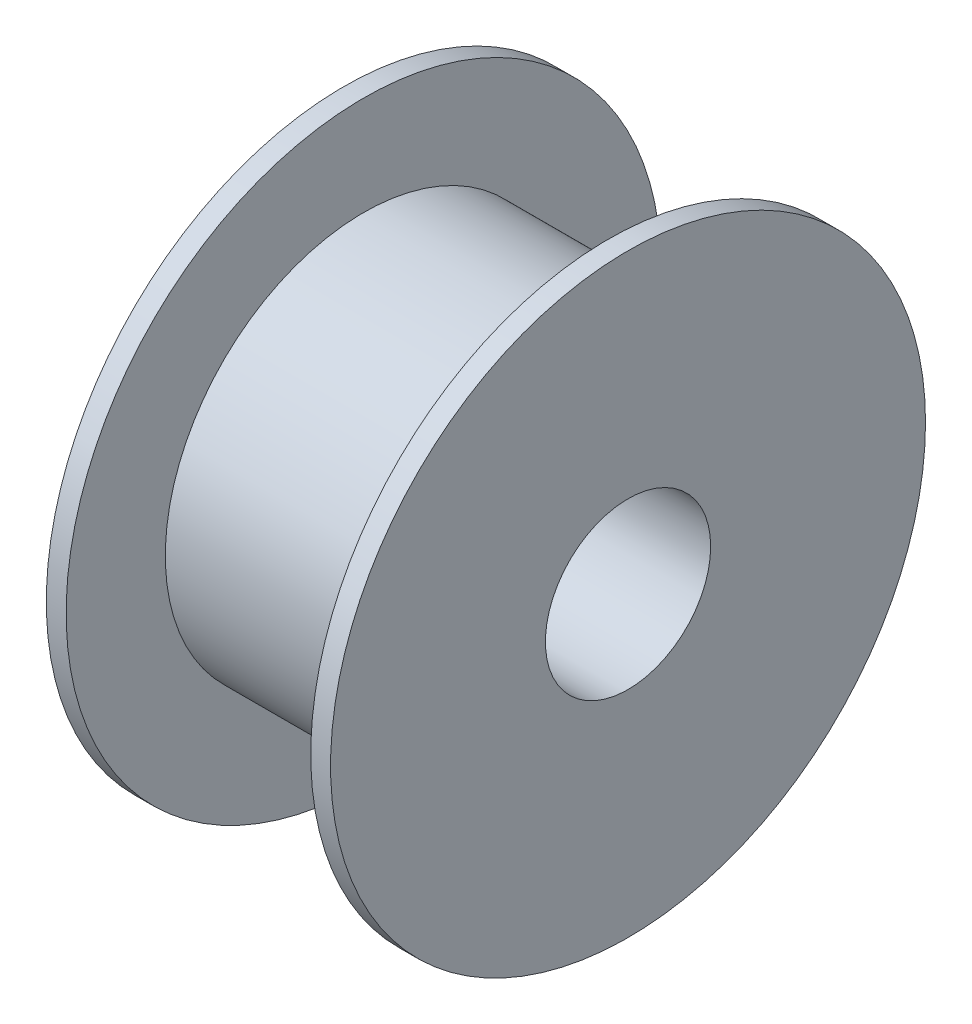
ISO-10303-21;
HEADER;
FILE_DESCRIPTION(('STEP AP214'),'2;1');
FILE_NAME('part.step','',(''),(''),'','','');
FILE_SCHEMA(('AUTOMOTIVE_DESIGN { 1 0 10303 214 1 1 1 1 }'));
ENDSEC;
DATA;
#1=APPLICATION_CONTEXT('core data for automotive mechanical design processes');
#2=APPLICATION_PROTOCOL_DEFINITION('international standard','automotive_design',2000,#1);
#3=PRODUCT_CONTEXT('',#1,'mechanical');
#4=PRODUCT('Part','Part','',(#3));
#5=PRODUCT_RELATED_PRODUCT_CATEGORY('part','',(#4));
#6=PRODUCT_DEFINITION_FORMATION('','',#4);
#7=PRODUCT_DEFINITION_CONTEXT('part definition',#1,'design');
#8=PRODUCT_DEFINITION('design','',#6,#7);
#9=PRODUCT_DEFINITION_SHAPE('','',#8);
#10=(LENGTH_UNIT() NAMED_UNIT(*) SI_UNIT(.MILLI.,.METRE.));
#11=(NAMED_UNIT(*) PLANE_ANGLE_UNIT() SI_UNIT($,.RADIAN.));
#12=(NAMED_UNIT(*) SI_UNIT($,.STERADIAN.) SOLID_ANGLE_UNIT());
#13=UNCERTAINTY_MEASURE_WITH_UNIT(LENGTH_MEASURE(1.E-05),#10,'distance_accuracy_value','');
#14=(GEOMETRIC_REPRESENTATION_CONTEXT(3) GLOBAL_UNCERTAINTY_ASSIGNED_CONTEXT((#13)) GLOBAL_UNIT_ASSIGNED_CONTEXT((#10,
#11,#12)) REPRESENTATION_CONTEXT('',''));
#15=CARTESIAN_POINT('',(0.,0.,0.));
#16=DIRECTION('',(0.,0.,1.));
#17=DIRECTION('',(1.,0.,0.));
#18=AXIS2_PLACEMENT_3D('',#15,#16,#17);
#19=CARTESIAN_POINT('',(-0.600000000000001,9.,0.));
#20=DIRECTION('',(-1.,0.,0.));
#21=DIRECTION('',(0.,0.,1.));
#22=AXIS2_PLACEMENT_3D('',#19,#20,#21);
#23=PLANE('',#22);
#24=CARTESIAN_POINT('',(-0.6,0.,0.));
#25=DIRECTION('',(1.,0.,0.));
#26=DIRECTION('',(0.,0.,-1.));
#27=AXIS2_PLACEMENT_3D('',#24,#25,#26);
#28=CIRCLE('',#27,2.5);
#29=CARTESIAN_POINT('',(-0.6,0.,-2.5));
#30=VERTEX_POINT('',#29);
#31=EDGE_CURVE('E10',#30,#30,#28,.T.);
#32=ORIENTED_EDGE('',*,*,#31,.T.);
#33=EDGE_LOOP('',(#32));
#34=FACE_BOUND('',#33,.T.);
#35=CARTESIAN_POINT('',(-0.600000000000001,0.,0.));
#36=DIRECTION('',(1.,0.,0.));
#37=DIRECTION('',(0.,0.,-1.));
#38=AXIS2_PLACEMENT_3D('',#35,#36,#37);
#39=CIRCLE('',#38,9.);
#40=CARTESIAN_POINT('',(-0.600000000000001,0.,-9.));
#41=VERTEX_POINT('',#40);
#42=EDGE_CURVE('E63',#41,#41,#39,.T.);
#43=ORIENTED_EDGE('',*,*,#42,.F.);
#44=EDGE_LOOP('',(#43));
#45=FACE_BOUND('',#44,.T.);
#46=ADVANCED_FACE('F35',(#34,#45),#23,.T.);
#47=CARTESIAN_POINT('',(-0.600000000000001,0.,0.));
#48=DIRECTION('',(1.,0.,0.));
#49=DIRECTION('',(0.,0.,-1.));
#50=AXIS2_PLACEMENT_3D('',#47,#48,#49);
#51=CYLINDRICAL_SURFACE('',#50,2.5);
#52=CARTESIAN_POINT('',(8.,0.,0.));
#53=DIRECTION('',(1.,0.,0.));
#54=DIRECTION('',(0.,0.,-1.));
#55=AXIS2_PLACEMENT_3D('',#52,#53,#54);
#56=CIRCLE('',#55,2.5);
#57=CARTESIAN_POINT('',(8.,0.,-2.5));
#58=VERTEX_POINT('',#57);
#59=EDGE_CURVE('E41',#58,#58,#56,.T.);
#60=ORIENTED_EDGE('',*,*,#59,.T.);
#61=EDGE_LOOP('',(#60));
#62=FACE_BOUND('',#61,.T.);
#63=ORIENTED_EDGE('',*,*,#31,.F.);
#64=EDGE_LOOP('',(#63));
#65=FACE_BOUND('',#64,.T.);
#66=ADVANCED_FACE('F71',(#62,#65),#51,.F.);
#67=CARTESIAN_POINT('',(8.,2.5,0.));
#68=DIRECTION('',(1.,0.,0.));
#69=DIRECTION('',(0.,0.,-1.));
#70=AXIS2_PLACEMENT_3D('',#67,#68,#69);
#71=PLANE('',#70);
#72=CARTESIAN_POINT('',(8.,0.,0.));
#73=DIRECTION('',(1.,0.,0.));
#74=DIRECTION('',(0.,0.,-1.));
#75=AXIS2_PLACEMENT_3D('',#72,#73,#74);
#76=CIRCLE('',#75,9.);
#77=CARTESIAN_POINT('',(8.,0.,-9.));
#78=VERTEX_POINT('',#77);
#79=EDGE_CURVE('E45',#78,#78,#76,.T.);
#80=ORIENTED_EDGE('',*,*,#79,.T.);
#81=EDGE_LOOP('',(#80));
#82=FACE_BOUND('',#81,.T.);
#83=ORIENTED_EDGE('',*,*,#59,.F.);
#84=EDGE_LOOP('',(#83));
#85=FACE_BOUND('',#84,.T.);
#86=ADVANCED_FACE('F75',(#82,#85),#71,.T.);
#87=CARTESIAN_POINT('',(-0.600000000000001,0.,0.));
#88=DIRECTION('',(1.,0.,0.));
#89=DIRECTION('',(0.,0.,-1.));
#90=AXIS2_PLACEMENT_3D('',#87,#88,#89);
#91=CYLINDRICAL_SURFACE('',#90,9.);
#92=CARTESIAN_POINT('',(7.4,0.,0.));
#93=DIRECTION('',(1.,0.,0.));
#94=DIRECTION('',(0.,0.,-1.));
#95=AXIS2_PLACEMENT_3D('',#92,#93,#94);
#96=CIRCLE('',#95,9.);
#97=CARTESIAN_POINT('',(7.4,0.,-9.));
#98=VERTEX_POINT('',#97);
#99=EDGE_CURVE('E49',#98,#98,#96,.T.);
#100=ORIENTED_EDGE('',*,*,#99,.T.);
#101=EDGE_LOOP('',(#100));
#102=FACE_BOUND('',#101,.T.);
#103=ORIENTED_EDGE('',*,*,#79,.F.);
#104=EDGE_LOOP('',(#103));
#105=FACE_BOUND('',#104,.T.);
#106=ADVANCED_FACE('F79',(#102,#105),#91,.T.);
#107=CARTESIAN_POINT('',(7.4,9.,0.));
#108=DIRECTION('',(-1.,0.,0.));
#109=DIRECTION('',(0.,0.,1.));
#110=AXIS2_PLACEMENT_3D('',#107,#108,#109);
#111=PLANE('',#110);
#112=CARTESIAN_POINT('',(7.4,0.,0.));
#113=DIRECTION('',(1.,0.,0.));
#114=DIRECTION('',(0.,0.,-1.));
#115=AXIS2_PLACEMENT_3D('',#112,#113,#114);
#116=CIRCLE('',#115,6.);
#117=CARTESIAN_POINT('',(7.4,0.,-6.));
#118=VERTEX_POINT('',#117);
#119=EDGE_CURVE('E54',#118,#118,#116,.T.);
#120=ORIENTED_EDGE('',*,*,#119,.T.);
#121=EDGE_LOOP('',(#120));
#122=FACE_BOUND('',#121,.T.);
#123=ORIENTED_EDGE('',*,*,#99,.F.);
#124=EDGE_LOOP('',(#123));
#125=FACE_BOUND('',#124,.T.);
#126=ADVANCED_FACE('F86',(#122,#125),#111,.T.);
#127=CARTESIAN_POINT('',(-0.600000000000001,0.,0.));
#128=DIRECTION('',(1.,0.,0.));
#129=DIRECTION('',(0.,0.,-1.));
#130=AXIS2_PLACEMENT_3D('',#127,#128,#129);
#131=CYLINDRICAL_SURFACE('',#130,6.);
#132=CARTESIAN_POINT('',(0.,0.,0.));
#133=DIRECTION('',(1.,0.,0.));
#134=DIRECTION('',(0.,0.,-1.));
#135=AXIS2_PLACEMENT_3D('',#132,#133,#134);
#136=CIRCLE('',#135,6.);
#137=CARTESIAN_POINT('',(0.,0.,-6.));
#138=VERTEX_POINT('',#137);
#139=EDGE_CURVE('E57',#138,#138,#136,.T.);
#140=ORIENTED_EDGE('',*,*,#139,.T.);
#141=EDGE_LOOP('',(#140));
#142=FACE_BOUND('',#141,.T.);
#143=ORIENTED_EDGE('',*,*,#119,.F.);
#144=EDGE_LOOP('',(#143));
#145=FACE_BOUND('',#144,.T.);
#146=ADVANCED_FACE('F90',(#142,#145),#131,.T.);
#147=CARTESIAN_POINT('',(0.,6.,0.));
#148=DIRECTION('',(1.,0.,0.));
#149=DIRECTION('',(0.,0.,-1.));
#150=AXIS2_PLACEMENT_3D('',#147,#148,#149);
#151=PLANE('',#150);
#152=CARTESIAN_POINT('',(0.,0.,0.));
#153=DIRECTION('',(1.,0.,0.));
#154=DIRECTION('',(0.,0.,-1.));
#155=AXIS2_PLACEMENT_3D('',#152,#153,#154);
#156=CIRCLE('',#155,9.);
#157=CARTESIAN_POINT('',(0.,0.,-9.));
#158=VERTEX_POINT('',#157);
#159=EDGE_CURVE('E60',#158,#158,#156,.T.);
#160=ORIENTED_EDGE('',*,*,#159,.T.);
#161=EDGE_LOOP('',(#160));
#162=FACE_BOUND('',#161,.T.);
#163=ORIENTED_EDGE('',*,*,#139,.F.);
#164=EDGE_LOOP('',(#163));
#165=FACE_BOUND('',#164,.T.);
#166=ADVANCED_FACE('F94',(#162,#165),#151,.T.);
#167=CARTESIAN_POINT('',(-0.600000000000001,0.,0.));
#168=DIRECTION('',(1.,0.,0.));
#169=DIRECTION('',(0.,0.,-1.));
#170=AXIS2_PLACEMENT_3D('',#167,#168,#169);
#171=CYLINDRICAL_SURFACE('',#170,9.);
#172=ORIENTED_EDGE('',*,*,#42,.T.);
#173=EDGE_LOOP('',(#172));
#174=FACE_BOUND('',#173,.T.);
#175=ORIENTED_EDGE('',*,*,#159,.F.);
#176=EDGE_LOOP('',(#175));
#177=FACE_BOUND('',#176,.T.);
#178=ADVANCED_FACE('F67',(#174,#177),#171,.T.);
#179=CLOSED_SHELL('',(#46,#66,#86,#106,#126,#146,#166,#178));
#180=MANIFOLD_SOLID_BREP('B2',#179);
#181=ADVANCED_BREP_SHAPE_REPRESENTATION('',(#18,#180),#14);
#182=SHAPE_DEFINITION_REPRESENTATION(#9,#181);
ENDSEC;
END-ISO-10303-21;
